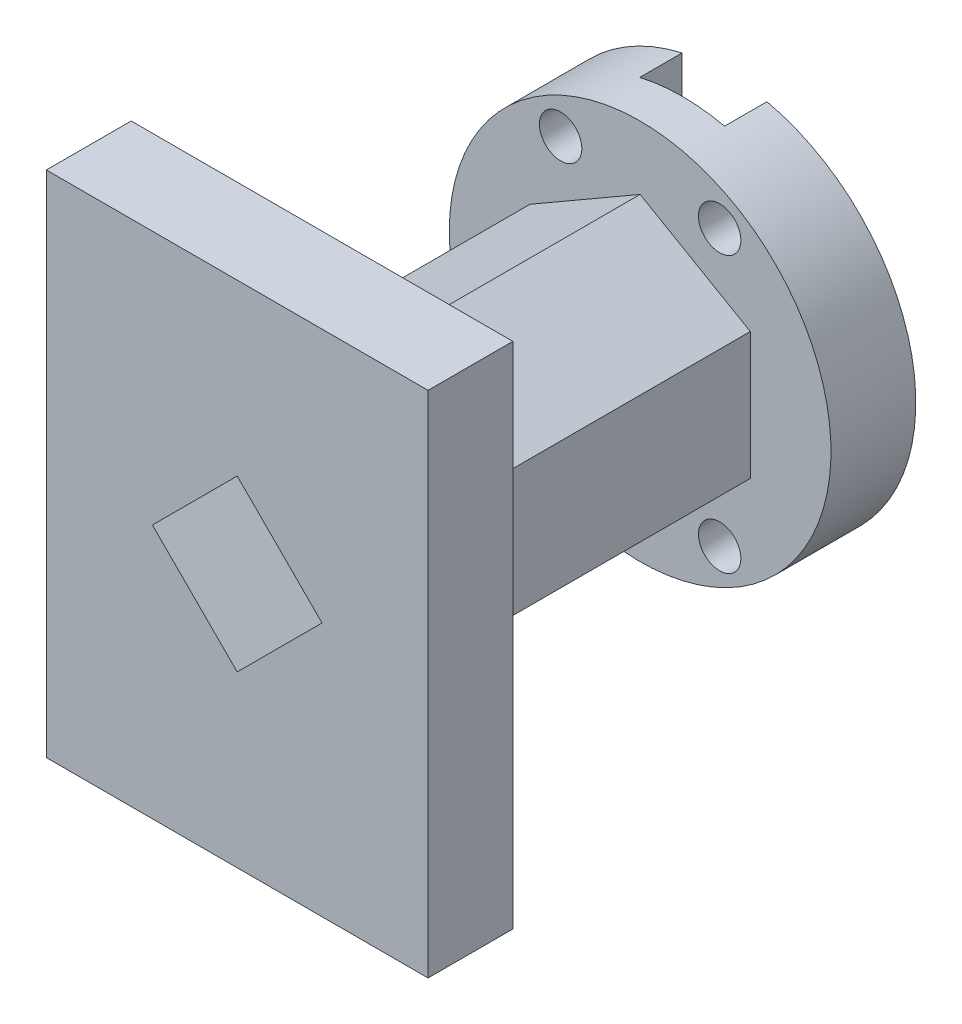
ISO-10303-21;
HEADER;
FILE_DESCRIPTION(('STEP AP214'),'2;1');
FILE_NAME('part.step','',(''),(''),'','','');
FILE_SCHEMA(('AUTOMOTIVE_DESIGN { 1 0 10303 214 1 1 1 1 }'));
ENDSEC;
DATA;
#1=APPLICATION_CONTEXT('core data for automotive mechanical design processes');
#2=APPLICATION_PROTOCOL_DEFINITION('international standard','automotive_design',2000,#1);
#3=PRODUCT_CONTEXT('',#1,'mechanical');
#4=PRODUCT('Part','Part','',(#3));
#5=PRODUCT_RELATED_PRODUCT_CATEGORY('part','',(#4));
#6=PRODUCT_DEFINITION_FORMATION('','',#4);
#7=PRODUCT_DEFINITION_CONTEXT('part definition',#1,'design');
#8=PRODUCT_DEFINITION('design','',#6,#7);
#9=PRODUCT_DEFINITION_SHAPE('','',#8);
#10=(LENGTH_UNIT() NAMED_UNIT(*) SI_UNIT(.MILLI.,.METRE.));
#11=(NAMED_UNIT(*) PLANE_ANGLE_UNIT() SI_UNIT($,.RADIAN.));
#12=(NAMED_UNIT(*) SI_UNIT($,.STERADIAN.) SOLID_ANGLE_UNIT());
#13=UNCERTAINTY_MEASURE_WITH_UNIT(LENGTH_MEASURE(1.E-05),#10,'distance_accuracy_value','');
#14=(GEOMETRIC_REPRESENTATION_CONTEXT(3) GLOBAL_UNCERTAINTY_ASSIGNED_CONTEXT((#13)) GLOBAL_UNIT_ASSIGNED_CONTEXT((#10,
#11,#12)) REPRESENTATION_CONTEXT('',''));
#15=CARTESIAN_POINT('',(0.,0.,0.));
#16=DIRECTION('',(0.,0.,1.));
#17=DIRECTION('',(1.,0.,0.));
#18=AXIS2_PLACEMENT_3D('',#15,#16,#17);
#19=CARTESIAN_POINT('',(0.,0.,-85.));
#20=DIRECTION('',(0.,0.,-1.));
#21=DIRECTION('',(-1.,0.,0.));
#22=AXIS2_PLACEMENT_3D('',#19,#20,#21);
#23=PLANE('',#22);
#24=DIRECTION('',(-0.707106781186547,0.707106781186548,0.));
#25=VECTOR('',#24,1.);
#26=CARTESIAN_POINT('',(-30.2974920931039,-30.2974920931039,-85.));
#27=LINE('',#26,#25);
#28=CARTESIAN_POINT('',(-78.0964504418021,17.5014662555944,-85.));
#29=VERTEX_POINT('',#28);
#30=CARTESIAN_POINT('',(-88.1832926056,27.5883084193922,-85.));
#31=VERTEX_POINT('',#30);
#32=EDGE_CURVE('E62',#29,#31,#27,.T.);
#33=ORIENTED_EDGE('',*,*,#32,.F.);
#34=DIRECTION('',(-0.707106781186547,-0.707106781186548,0.));
#35=VECTOR('',#34,1.);
#36=CARTESIAN_POINT('',(-47.7989583486983,47.7989583486982,-85.));
#37=LINE('',#36,#35);
#38=CARTESIAN_POINT('',(-68.1832926056,27.4146240917965,-85.));
#39=VERTEX_POINT('',#38);
#40=EDGE_CURVE('E236',#39,#29,#37,.T.);
#41=ORIENTED_EDGE('',*,*,#40,.F.);
#42=DIRECTION('',(0.,1.,0.));
#43=VECTOR('',#42,1.);
#44=CARTESIAN_POINT('',(-68.1832926056,-12.4286913438041,-85.));
#45=LINE('',#44,#43);
#46=CARTESIAN_POINT('',(-68.1832926056,-6.39305847944001,-85.));
#47=VERTEX_POINT('',#46);
#48=EDGE_CURVE('E267',#47,#39,#45,.T.);
#49=ORIENTED_EDGE('',*,*,#48,.F.);
#50=CARTESIAN_POINT('',(-78.0964504418022,37.5014662555944,-85.));
#51=DIRECTION('',(0.,0.,-1.));
#52=DIRECTION('',(-1.,0.,0.));
#53=AXIS2_PLACEMENT_3D('',#50,#51,#52);
#54=CIRCLE('',#53,45.);
#55=CARTESIAN_POINT('',(-88.1832926056,-6.35347206567834,-85.));
#56=VERTEX_POINT('',#55);
#57=EDGE_CURVE('E377',#47,#56,#54,.T.);
#58=ORIENTED_EDGE('',*,*,#57,.T.);
#59=DIRECTION('',(0.,1.,0.));
#60=VECTOR('',#59,1.);
#61=CARTESIAN_POINT('',(-88.1832926056,-12.4286913438041,-85.));
#62=LINE('',#61,#60);
#63=EDGE_CURVE('E263',#56,#31,#62,.T.);
#64=ORIENTED_EDGE('',*,*,#63,.T.);
#65=EDGE_LOOP('',(#33,#41,#49,#58,#64));
#66=FACE_BOUND('',#65,.T.);
#67=ADVANCED_FACE('F39',(#66),#23,.T.);
#68=CARTESIAN_POINT('',(-68.1832926056,-12.4286913438041,-85.));
#69=DIRECTION('',(-1.,0.,0.));
#70=DIRECTION('',(0.,0.,1.));
#71=AXIS2_PLACEMENT_3D('',#68,#69,#70);
#72=PLANE('',#71);
#73=DIRECTION('',(0.,0.,1.));
#74=VECTOR('',#73,1.);
#75=CARTESIAN_POINT('',(-68.1832926056,27.4146240917965,-85.));
#76=LINE('',#75,#74);
#77=CARTESIAN_POINT('',(-68.1832926056,27.4146240917965,-95.));
#78=VERTEX_POINT('',#77);
#79=EDGE_CURVE('E11',#78,#39,#76,.T.);
#80=ORIENTED_EDGE('',*,*,#79,.F.);
#81=DIRECTION('',(0.,1.,0.));
#82=VECTOR('',#81,1.);
#83=CARTESIAN_POINT('',(-68.1832926056,0.,-95.));
#84=LINE('',#83,#82);
#85=CARTESIAN_POINT('',(-68.1832926056,-6.39305847944001,-95.));
#86=VERTEX_POINT('',#85);
#87=EDGE_CURVE('E374',#86,#78,#84,.T.);
#88=ORIENTED_EDGE('',*,*,#87,.F.);
#89=DIRECTION('',(0.,0.,1.));
#90=VECTOR('',#89,1.);
#91=CARTESIAN_POINT('',(-68.1832926056,-6.39305847944001,-95.));
#92=LINE('',#91,#90);
#93=EDGE_CURVE('E279',#86,#47,#92,.T.);
#94=ORIENTED_EDGE('',*,*,#93,.T.);
#95=ORIENTED_EDGE('',*,*,#48,.T.);
#96=EDGE_LOOP('',(#80,#88,#94,#95));
#97=FACE_BOUND('',#96,.T.);
#98=ADVANCED_FACE('F405',(#97),#72,.T.);
#99=CARTESIAN_POINT('',(-88.1832926056,-12.4286913438041,-85.));
#100=DIRECTION('',(-1.,0.,0.));
#101=DIRECTION('',(0.,0.,1.));
#102=AXIS2_PLACEMENT_3D('',#99,#100,#101);
#103=PLANE('',#102);
#104=CARTESIAN_POINT('',(-88.1832926056,47.4146240917965,-85.));
#105=VERTEX_POINT('',#104);
#106=CARTESIAN_POINT('',(-88.1832926056,81.356404576867,-85.));
#107=VERTEX_POINT('',#106);
#108=EDGE_CURVE('E262',#105,#107,#62,.T.);
#109=ORIENTED_EDGE('',*,*,#108,.F.);
#110=DIRECTION('',(0.,0.,-1.));
#111=VECTOR('',#110,1.);
#112=CARTESIAN_POINT('',(-88.1832926056,47.4146240917965,-85.));
#113=LINE('',#112,#111);
#114=CARTESIAN_POINT('',(-88.1832926056,47.4146240917965,-95.));
#115=VERTEX_POINT('',#114);
#116=EDGE_CURVE('E381',#105,#115,#113,.T.);
#117=ORIENTED_EDGE('',*,*,#116,.T.);
#118=DIRECTION('',(0.,1.,0.));
#119=VECTOR('',#118,1.);
#120=CARTESIAN_POINT('',(-88.1832926056,0.,-95.));
#121=LINE('',#120,#119);
#122=CARTESIAN_POINT('',(-88.1832926056,81.356404576867,-95.));
#123=VERTEX_POINT('',#122);
#124=EDGE_CURVE('E212',#115,#123,#121,.T.);
#125=ORIENTED_EDGE('',*,*,#124,.T.);
#126=DIRECTION('',(0.,0.,1.));
#127=VECTOR('',#126,1.);
#128=CARTESIAN_POINT('',(-88.1832926056,81.356404576867,-95.));
#129=LINE('',#128,#127);
#130=EDGE_CURVE('E270',#107,#123,#129,.F.);
#131=ORIENTED_EDGE('',*,*,#130,.F.);
#132=EDGE_LOOP('',(#109,#117,#125,#131));
#133=FACE_BOUND('',#132,.T.);
#134=ADVANCED_FACE('F417',(#133),#103,.F.);
#135=CARTESIAN_POINT('',(0.,0.,-95.));
#136=DIRECTION('',(0.,0.,-1.));
#137=DIRECTION('',(-1.,0.,0.));
#138=AXIS2_PLACEMENT_3D('',#135,#136,#137);
#139=PLANE('',#138);
#140=DIRECTION('',(0.707106781186547,0.707106781186548,0.));
#141=VECTOR('',#140,1.);
#142=CARTESIAN_POINT('',(-78.0964504418021,17.5014662555944,-95.));
#143=LINE('',#142,#141);
#144=CARTESIAN_POINT('',(-58.0964504418021,37.5014662555944,-95.));
#145=VERTEX_POINT('',#144);
#146=EDGE_CURVE('E225',#78,#145,#143,.T.);
#147=ORIENTED_EDGE('',*,*,#146,.T.);
#148=DIRECTION('',(-0.707106781186547,0.707106781186548,0.));
#149=VECTOR('',#148,1.);
#150=CARTESIAN_POINT('',(-58.0964504418021,37.5014662555944,-95.));
#151=LINE('',#150,#149);
#152=CARTESIAN_POINT('',(-68.1832926056,47.5883084193923,-95.));
#153=VERTEX_POINT('',#152);
#154=EDGE_CURVE('E220',#145,#153,#151,.T.);
#155=ORIENTED_EDGE('',*,*,#154,.T.);
#156=CARTESIAN_POINT('',(-68.1832926056,81.3959909906287,-95.));
#157=VERTEX_POINT('',#156);
#158=EDGE_CURVE('E373',#153,#157,#84,.T.);
#159=ORIENTED_EDGE('',*,*,#158,.T.);
#160=CARTESIAN_POINT('',(-78.0964504418022,37.5014662555944,-95.));
#161=DIRECTION('',(0.,0.,-1.));
#162=DIRECTION('',(-1.,0.,0.));
#163=AXIS2_PLACEMENT_3D('',#160,#161,#162);
#164=CIRCLE('',#163,45.);
#165=EDGE_CURVE('E284',#157,#86,#164,.T.);
#166=ORIENTED_EDGE('',*,*,#165,.T.);
#167=ORIENTED_EDGE('',*,*,#87,.T.);
#168=EDGE_LOOP('',(#147,#155,#159,#166,#167));
#169=FACE_BOUND('',#168,.T.);
#170=CARTESIAN_POINT('',(-59.3464504418024,69.9774188975109,-95.));
#171=DIRECTION('',(0.,0.,-1.));
#172=DIRECTION('',(-1.,0.,0.));
#173=AXIS2_PLACEMENT_3D('',#170,#171,#172);
#174=CIRCLE('',#173,5.00000000000003);
#175=CARTESIAN_POINT('',(-64.3464504418024,69.9774188975109,-95.));
#176=VERTEX_POINT('',#175);
#177=EDGE_CURVE('E252',#176,#176,#174,.T.);
#178=ORIENTED_EDGE('',*,*,#177,.F.);
#179=EDGE_LOOP('',(#178));
#180=FACE_BOUND('',#179,.T.);
#181=CARTESIAN_POINT('',(-59.3464504418024,5.02551361367777,-95.));
#182=DIRECTION('',(0.,0.,-1.));
#183=DIRECTION('',(-1.,0.,0.));
#184=AXIS2_PLACEMENT_3D('',#181,#182,#183);
#185=CIRCLE('',#184,5.00000000000002);
#186=CARTESIAN_POINT('',(-64.3464504418024,5.02551361367777,-95.));
#187=VERTEX_POINT('',#186);
#188=EDGE_CURVE('E244',#187,#187,#185,.F.);
#189=ORIENTED_EDGE('',*,*,#188,.T.);
#190=EDGE_LOOP('',(#189));
#191=FACE_BOUND('',#190,.T.);
#192=ADVANCED_FACE('F391',(#169,#180,#191),#139,.T.);
#193=CARTESIAN_POINT('',(0.,0.,-75.));
#194=DIRECTION('',(0.,0.,-1.));
#195=DIRECTION('',(-1.,0.,0.));
#196=AXIS2_PLACEMENT_3D('',#193,#194,#195);
#197=PLANE('',#196);
#198=CARTESIAN_POINT('',(-96.846450441802,5.02551361367777,-75.));
#199=DIRECTION('',(0.,0.,-1.));
#200=DIRECTION('',(-1.,0.,0.));
#201=AXIS2_PLACEMENT_3D('',#198,#199,#200);
#202=CIRCLE('',#201,5.00000000000002);
#203=CARTESIAN_POINT('',(-101.846450441802,5.02551361367777,-75.));
#204=VERTEX_POINT('',#203);
#205=EDGE_CURVE('E241',#204,#204,#202,.F.);
#206=ORIENTED_EDGE('',*,*,#205,.F.);
#207=EDGE_LOOP('',(#206));
#208=FACE_BOUND('',#207,.T.);
#209=CARTESIAN_POINT('',(-59.3464504418024,69.9774188975109,-75.));
#210=DIRECTION('',(0.,0.,-1.));
#211=DIRECTION('',(-1.,0.,0.));
#212=AXIS2_PLACEMENT_3D('',#209,#210,#211);
#213=CIRCLE('',#212,5.00000000000003);
#214=CARTESIAN_POINT('',(-64.3464504418024,69.9774188975109,-75.));
#215=VERTEX_POINT('',#214);
#216=EDGE_CURVE('E259',#215,#215,#213,.F.);
#217=ORIENTED_EDGE('',*,*,#216,.F.);
#218=EDGE_LOOP('',(#217));
#219=FACE_BOUND('',#218,.T.);
#220=CARTESIAN_POINT('',(-78.0964504418022,37.5014662555944,-75.));
#221=DIRECTION('',(0.,0.,-1.));
#222=DIRECTION('',(-1.,0.,0.));
#223=AXIS2_PLACEMENT_3D('',#220,#221,#222);
#224=CIRCLE('',#223,45.);
#225=CARTESIAN_POINT('',(-123.096450441802,37.5014662555944,-75.));
#226=VERTEX_POINT('',#225);
#227=EDGE_CURVE('E281',#226,#226,#224,.T.);
#228=ORIENTED_EDGE('',*,*,#227,.F.);
#229=EDGE_LOOP('',(#228));
#230=FACE_BOUND('',#229,.T.);
#231=DIRECTION('',(0.866025403784442,0.499999999999995,0.));
#232=VECTOR('',#231,1.);
#233=CARTESIAN_POINT('',(-104.077212555335,52.5014662555946,-75.));
#234=LINE('',#233,#232);
#235=CARTESIAN_POINT('',(-104.077212555335,52.5014662555946,-75.));
#236=VERTEX_POINT('',#235);
#237=CARTESIAN_POINT('',(-78.0964504418021,67.5014662555944,-75.));
#238=VERTEX_POINT('',#237);
#239=EDGE_CURVE('E303',#236,#238,#234,.T.);
#240=ORIENTED_EDGE('',*,*,#239,.T.);
#241=DIRECTION('',(0.866025403784438,-0.500000000000001,0.));
#242=VECTOR('',#241,1.);
#243=CARTESIAN_POINT('',(-78.0964504418021,67.5014662555944,-75.));
#244=LINE('',#243,#242);
#245=CARTESIAN_POINT('',(-52.1156883282689,52.5014662555943,-75.));
#246=VERTEX_POINT('',#245);
#247=EDGE_CURVE('E287',#238,#246,#244,.T.);
#248=ORIENTED_EDGE('',*,*,#247,.T.);
#249=DIRECTION('',(0.,-1.,0.));
#250=VECTOR('',#249,1.);
#251=CARTESIAN_POINT('',(-52.1156883282689,52.5014662555943,-75.));
#252=LINE('',#251,#250);
#253=CARTESIAN_POINT('',(-52.115688328269,22.5014662555942,-75.));
#254=VERTEX_POINT('',#253);
#255=EDGE_CURVE('E290',#246,#254,#252,.T.);
#256=ORIENTED_EDGE('',*,*,#255,.T.);
#257=DIRECTION('',(-0.866025403784442,-0.499999999999995,0.));
#258=VECTOR('',#257,1.);
#259=CARTESIAN_POINT('',(-52.115688328269,22.5014662555942,-75.));
#260=LINE('',#259,#258);
#261=CARTESIAN_POINT('',(-78.0964504418023,7.50146625559435,-75.));
#262=VERTEX_POINT('',#261);
#263=EDGE_CURVE('E294',#254,#262,#260,.T.);
#264=ORIENTED_EDGE('',*,*,#263,.T.);
#265=DIRECTION('',(-0.866025403784435,0.500000000000007,0.));
#266=VECTOR('',#265,1.);
#267=CARTESIAN_POINT('',(-78.0964504418023,7.50146625559435,-75.));
#268=LINE('',#267,#266);
#269=CARTESIAN_POINT('',(-104.077212555335,22.5014662555946,-75.));
#270=VERTEX_POINT('',#269);
#271=EDGE_CURVE('E297',#262,#270,#268,.T.);
#272=ORIENTED_EDGE('',*,*,#271,.T.);
#273=DIRECTION('',(0.,1.,0.));
#274=VECTOR('',#273,1.);
#275=CARTESIAN_POINT('',(-104.077212555335,22.5014662555946,-75.));
#276=LINE('',#275,#274);
#277=EDGE_CURVE('E300',#270,#236,#276,.T.);
#278=ORIENTED_EDGE('',*,*,#277,.T.);
#279=EDGE_LOOP('',(#240,#248,#256,#264,#272,#278));
#280=FACE_BOUND('',#279,.T.);
#281=CARTESIAN_POINT('',(-59.3464504418024,5.02551361367777,-75.));
#282=DIRECTION('',(0.,0.,-1.));
#283=DIRECTION('',(-1.,0.,0.));
#284=AXIS2_PLACEMENT_3D('',#281,#282,#283);
#285=CIRCLE('',#284,5.00000000000002);
#286=CARTESIAN_POINT('',(-64.3464504418024,5.02551361367777,-75.));
#287=VERTEX_POINT('',#286);
#288=EDGE_CURVE('E249',#287,#287,#285,.T.);
#289=ORIENTED_EDGE('',*,*,#288,.T.);
#290=EDGE_LOOP('',(#289));
#291=FACE_BOUND('',#290,.T.);
#292=CARTESIAN_POINT('',(-96.846450441802,69.9774188975109,-75.));
#293=DIRECTION('',(0.,0.,-1.));
#294=DIRECTION('',(-1.,0.,0.));
#295=AXIS2_PLACEMENT_3D('',#292,#293,#294);
#296=CIRCLE('',#295,5.00000000000002);
#297=CARTESIAN_POINT('',(-101.846450441802,69.9774188975109,-75.));
#298=VERTEX_POINT('',#297);
#299=EDGE_CURVE('E248',#298,#298,#296,.T.);
#300=ORIENTED_EDGE('',*,*,#299,.T.);
#301=EDGE_LOOP('',(#300));
#302=FACE_BOUND('',#301,.T.);
#303=ADVANCED_FACE('F446',(#208,#219,#230,#280,#291,#302),#197,.F.);
#304=DIRECTION('',(-0.707106781186548,-0.707106781186548,0.));
#305=VECTOR('',#304,1.);
#306=CARTESIAN_POINT('',(-78.0964504418021,57.5014662555944,-95.));
#307=LINE('',#306,#305);
#308=CARTESIAN_POINT('',(-98.0964504418021,37.5014662555944,-95.));
#309=VERTEX_POINT('',#308);
#310=EDGE_CURVE('E202',#115,#309,#307,.T.);
#311=ORIENTED_EDGE('',*,*,#310,.T.);
#312=DIRECTION('',(0.707106781186547,-0.707106781186548,0.));
#313=VECTOR('',#312,1.);
#314=CARTESIAN_POINT('',(-98.0964504418021,37.5014662555944,-95.));
#315=LINE('',#314,#313);
#316=CARTESIAN_POINT('',(-88.1832926056,27.5883084193922,-95.));
#317=VERTEX_POINT('',#316);
#318=EDGE_CURVE('E187',#309,#317,#315,.T.);
#319=ORIENTED_EDGE('',*,*,#318,.T.);
#320=CARTESIAN_POINT('',(-88.1832926056,-6.35347206567834,-95.));
#321=VERTEX_POINT('',#320);
#322=EDGE_CURVE('E371',#321,#317,#121,.T.);
#323=ORIENTED_EDGE('',*,*,#322,.F.);
#324=EDGE_CURVE('E282',#321,#123,#164,.T.);
#325=ORIENTED_EDGE('',*,*,#324,.T.);
#326=ORIENTED_EDGE('',*,*,#124,.F.);
#327=EDGE_LOOP('',(#311,#319,#323,#325,#326));
#328=FACE_BOUND('',#327,.T.);
#329=CARTESIAN_POINT('',(-96.846450441802,5.02551361367777,-95.));
#330=DIRECTION('',(0.,0.,-1.));
#331=DIRECTION('',(-1.,0.,0.));
#332=AXIS2_PLACEMENT_3D('',#329,#330,#331);
#333=CIRCLE('',#332,5.00000000000002);
#334=CARTESIAN_POINT('',(-101.846450441802,5.02551361367777,-95.));
#335=VERTEX_POINT('',#334);
#336=EDGE_CURVE('E238',#335,#335,#333,.T.);
#337=ORIENTED_EDGE('',*,*,#336,.F.);
#338=EDGE_LOOP('',(#337));
#339=FACE_BOUND('',#338,.T.);
#340=CARTESIAN_POINT('',(-96.846450441802,69.9774188975109,-95.));
#341=DIRECTION('',(0.,0.,-1.));
#342=DIRECTION('',(-1.,0.,0.));
#343=AXIS2_PLACEMENT_3D('',#340,#341,#342);
#344=CIRCLE('',#343,5.00000000000002);
#345=CARTESIAN_POINT('',(-101.846450441802,69.9774188975109,-95.));
#346=VERTEX_POINT('',#345);
#347=EDGE_CURVE('E245',#346,#346,#344,.F.);
#348=ORIENTED_EDGE('',*,*,#347,.T.);
#349=EDGE_LOOP('',(#348));
#350=FACE_BOUND('',#349,.T.);
#351=ADVANCED_FACE('F209',(#328,#339,#350),#139,.T.);
#352=CARTESIAN_POINT('',(-78.0964504418022,37.5014662555944,-95.));
#353=DIRECTION('',(0.,0.,1.));
#354=DIRECTION('',(1.,0.,0.));
#355=AXIS2_PLACEMENT_3D('',#352,#353,#354);
#356=CYLINDRICAL_SURFACE('',#355,45.);
#357=ORIENTED_EDGE('',*,*,#227,.T.);
#358=EDGE_LOOP('',(#357));
#359=FACE_BOUND('',#358,.T.);
#360=DIRECTION('',(0.,0.,1.));
#361=VECTOR('',#360,1.);
#362=CARTESIAN_POINT('',(-68.1832926056,81.3959909906287,-95.));
#363=LINE('',#362,#361);
#364=CARTESIAN_POINT('',(-68.1832926056,81.3959909906287,-85.));
#365=VERTEX_POINT('',#364);
#366=EDGE_CURVE('E276',#365,#157,#363,.F.);
#367=ORIENTED_EDGE('',*,*,#366,.F.);
#368=EDGE_CURVE('E379',#107,#365,#54,.T.);
#369=ORIENTED_EDGE('',*,*,#368,.F.);
#370=ORIENTED_EDGE('',*,*,#130,.T.);
#371=ORIENTED_EDGE('',*,*,#324,.F.);
#372=DIRECTION('',(0.,0.,1.));
#373=VECTOR('',#372,1.);
#374=CARTESIAN_POINT('',(-88.1832926056,-6.35347206567834,-95.));
#375=LINE('',#374,#373);
#376=EDGE_CURVE('E273',#321,#56,#375,.T.);
#377=ORIENTED_EDGE('',*,*,#376,.T.);
#378=ORIENTED_EDGE('',*,*,#57,.F.);
#379=ORIENTED_EDGE('',*,*,#93,.F.);
#380=ORIENTED_EDGE('',*,*,#165,.F.);
#381=EDGE_LOOP('',(#367,#369,#370,#371,#377,#378,#379,#380));
#382=FACE_BOUND('',#381,.T.);
#383=ADVANCED_FACE('F401',(#359,#382),#356,.T.);
#384=CARTESIAN_POINT('',(-123.096450441802,-22.4985337444056,20.));
#385=DIRECTION('',(0.,1.,0.));
#386=DIRECTION('',(0.,0.,1.));
#387=AXIS2_PLACEMENT_3D('',#384,#385,#386);
#388=PLANE('',#387);
#389=DIRECTION('',(1.,0.,0.));
#390=VECTOR('',#389,1.);
#391=CARTESIAN_POINT('',(-123.096450441802,-22.4985337444056,0.));
#392=LINE('',#391,#390);
#393=CARTESIAN_POINT('',(-123.096450441802,-22.4985337444056,0.));
#394=VERTEX_POINT('',#393);
#395=CARTESIAN_POINT('',(-33.0964504418021,-22.4985337444056,0.));
#396=VERTEX_POINT('',#395);
#397=EDGE_CURVE('E341',#394,#396,#392,.T.);
#398=ORIENTED_EDGE('',*,*,#397,.T.);
#399=DIRECTION('',(0.,0.,-1.));
#400=VECTOR('',#399,1.);
#401=CARTESIAN_POINT('',(-33.0964504418021,-22.4985337444056,20.));
#402=LINE('',#401,#400);
#403=CARTESIAN_POINT('',(-33.0964504418021,-22.4985337444056,20.));
#404=VERTEX_POINT('',#403);
#405=EDGE_CURVE('E369',#404,#396,#402,.T.);
#406=ORIENTED_EDGE('',*,*,#405,.F.);
#407=DIRECTION('',(1.,0.,0.));
#408=VECTOR('',#407,1.);
#409=CARTESIAN_POINT('',(-123.096450441802,-22.4985337444056,20.));
#410=LINE('',#409,#408);
#411=CARTESIAN_POINT('',(-123.096450441802,-22.4985337444056,20.));
#412=VERTEX_POINT('',#411);
#413=EDGE_CURVE('E342',#412,#404,#410,.T.);
#414=ORIENTED_EDGE('',*,*,#413,.F.);
#415=DIRECTION('',(0.,0.,-1.));
#416=VECTOR('',#415,1.);
#417=CARTESIAN_POINT('',(-123.096450441802,-22.4985337444056,20.));
#418=LINE('',#417,#416);
#419=EDGE_CURVE('E353',#412,#394,#418,.T.);
#420=ORIENTED_EDGE('',*,*,#419,.T.);
#421=EDGE_LOOP('',(#398,#406,#414,#420));
#422=FACE_BOUND('',#421,.T.);
#423=ADVANCED_FACE('F41',(#422),#388,.F.);
#424=CARTESIAN_POINT('',(-33.0964504418021,97.5014662555944,20.));
#425=DIRECTION('',(1.,0.,0.));
#426=DIRECTION('',(0.,1.,0.));
#427=AXIS2_PLACEMENT_3D('',#424,#425,#426);
#428=PLANE('',#427);
#429=DIRECTION('',(0.,-1.,0.));
#430=VECTOR('',#429,1.);
#431=CARTESIAN_POINT('',(-33.0964504418021,97.5014662555944,0.));
#432=LINE('',#431,#430);
#433=CARTESIAN_POINT('',(-33.0964504418021,97.5014662555944,0.));
#434=VERTEX_POINT('',#433);
#435=EDGE_CURVE('E356',#434,#396,#432,.T.);
#436=ORIENTED_EDGE('',*,*,#435,.F.);
#437=DIRECTION('',(0.,0.,-1.));
#438=VECTOR('',#437,1.);
#439=CARTESIAN_POINT('',(-33.0964504418021,97.5014662555944,20.));
#440=LINE('',#439,#438);
#441=CARTESIAN_POINT('',(-33.0964504418021,97.5014662555944,20.));
#442=VERTEX_POINT('',#441);
#443=EDGE_CURVE('E367',#442,#434,#440,.T.);
#444=ORIENTED_EDGE('',*,*,#443,.F.);
#445=DIRECTION('',(0.,-1.,0.));
#446=VECTOR('',#445,1.);
#447=CARTESIAN_POINT('',(-33.0964504418021,97.5014662555944,20.));
#448=LINE('',#447,#446);
#449=EDGE_CURVE('E344',#442,#404,#448,.T.);
#450=ORIENTED_EDGE('',*,*,#449,.T.);
#451=ORIENTED_EDGE('',*,*,#405,.T.);
#452=EDGE_LOOP('',(#436,#444,#450,#451));
#453=FACE_BOUND('',#452,.T.);
#454=ADVANCED_FACE('F486',(#453),#428,.T.);
#455=CARTESIAN_POINT('',(-123.096450441802,97.5014662555944,20.));
#456=DIRECTION('',(0.,1.,0.));
#457=DIRECTION('',(0.,0.,1.));
#458=AXIS2_PLACEMENT_3D('',#455,#456,#457);
#459=PLANE('',#458);
#460=DIRECTION('',(1.,0.,0.));
#461=VECTOR('',#460,1.);
#462=CARTESIAN_POINT('',(-123.096450441802,97.5014662555944,0.));
#463=LINE('',#462,#461);
#464=CARTESIAN_POINT('',(-123.096450441802,97.5014662555944,0.));
#465=VERTEX_POINT('',#464);
#466=EDGE_CURVE('E359',#465,#434,#463,.T.);
#467=ORIENTED_EDGE('',*,*,#466,.F.);
#468=DIRECTION('',(0.,0.,-1.));
#469=VECTOR('',#468,1.);
#470=CARTESIAN_POINT('',(-123.096450441802,97.5014662555944,20.));
#471=LINE('',#470,#469);
#472=CARTESIAN_POINT('',(-123.096450441802,97.5014662555944,20.));
#473=VERTEX_POINT('',#472);
#474=EDGE_CURVE('E365',#473,#465,#471,.T.);
#475=ORIENTED_EDGE('',*,*,#474,.F.);
#476=DIRECTION('',(1.,0.,0.));
#477=VECTOR('',#476,1.);
#478=CARTESIAN_POINT('',(-123.096450441802,97.5014662555944,20.));
#479=LINE('',#478,#477);
#480=EDGE_CURVE('E348',#473,#442,#479,.T.);
#481=ORIENTED_EDGE('',*,*,#480,.T.);
#482=ORIENTED_EDGE('',*,*,#443,.T.);
#483=EDGE_LOOP('',(#467,#475,#481,#482));
#484=FACE_BOUND('',#483,.T.);
#485=ADVANCED_FACE('F483',(#484),#459,.T.);
#486=CARTESIAN_POINT('',(-123.096450441802,97.5014662555944,20.));
#487=DIRECTION('',(1.,0.,0.));
#488=DIRECTION('',(0.,1.,0.));
#489=AXIS2_PLACEMENT_3D('',#486,#487,#488);
#490=PLANE('',#489);
#491=DIRECTION('',(0.,-1.,0.));
#492=VECTOR('',#491,1.);
#493=CARTESIAN_POINT('',(-123.096450441802,97.5014662555944,0.));
#494=LINE('',#493,#492);
#495=EDGE_CURVE('E345',#465,#394,#494,.T.);
#496=ORIENTED_EDGE('',*,*,#495,.T.);
#497=ORIENTED_EDGE('',*,*,#419,.F.);
#498=DIRECTION('',(0.,-1.,0.));
#499=VECTOR('',#498,1.);
#500=CARTESIAN_POINT('',(-123.096450441802,97.5014662555944,20.));
#501=LINE('',#500,#499);
#502=EDGE_CURVE('E351',#473,#412,#501,.T.);
#503=ORIENTED_EDGE('',*,*,#502,.F.);
#504=ORIENTED_EDGE('',*,*,#474,.T.);
#505=EDGE_LOOP('',(#496,#497,#503,#504));
#506=FACE_BOUND('',#505,.T.);
#507=ADVANCED_FACE('F476',(#506),#490,.F.);
#508=CARTESIAN_POINT('',(0.,0.,20.));
#509=DIRECTION('',(0.,0.,-1.));
#510=DIRECTION('',(-1.,0.,0.));
#511=AXIS2_PLACEMENT_3D('',#508,#509,#510);
#512=PLANE('',#511);
#513=DIRECTION('',(0.707106781186547,-0.707106781186548,0.));
#514=VECTOR('',#513,1.);
#515=CARTESIAN_POINT('',(-98.0964504418021,37.5014662555944,20.));
#516=LINE('',#515,#514);
#517=CARTESIAN_POINT('',(-98.0964504418021,37.5014662555944,20.));
#518=VERTEX_POINT('',#517);
#519=CARTESIAN_POINT('',(-78.0964504418021,17.5014662555944,20.));
#520=VERTEX_POINT('',#519);
#521=EDGE_CURVE('E214',#518,#520,#516,.T.);
#522=ORIENTED_EDGE('',*,*,#521,.F.);
#523=DIRECTION('',(-0.707106781186547,-0.707106781186547,0.));
#524=VECTOR('',#523,1.);
#525=CARTESIAN_POINT('',(-78.0964504418021,57.5014662555944,20.));
#526=LINE('',#525,#524);
#527=CARTESIAN_POINT('',(-78.0964504418021,57.5014662555944,20.));
#528=VERTEX_POINT('',#527);
#529=EDGE_CURVE('E205',#528,#518,#526,.T.);
#530=ORIENTED_EDGE('',*,*,#529,.F.);
#531=DIRECTION('',(-0.707106781186547,0.707106781186548,0.));
#532=VECTOR('',#531,1.);
#533=CARTESIAN_POINT('',(-58.0964504418021,37.5014662555944,20.));
#534=LINE('',#533,#532);
#535=CARTESIAN_POINT('',(-58.0964504418021,37.5014662555944,20.));
#536=VERTEX_POINT('',#535);
#537=EDGE_CURVE('E218',#536,#528,#534,.T.);
#538=ORIENTED_EDGE('',*,*,#537,.F.);
#539=DIRECTION('',(0.707106781186547,0.707106781186548,0.));
#540=VECTOR('',#539,1.);
#541=CARTESIAN_POINT('',(-78.0964504418021,17.5014662555944,20.));
#542=LINE('',#541,#540);
#543=EDGE_CURVE('E54',#520,#536,#542,.T.);
#544=ORIENTED_EDGE('',*,*,#543,.F.);
#545=EDGE_LOOP('',(#522,#530,#538,#544));
#546=FACE_BOUND('',#545,.T.);
#547=ORIENTED_EDGE('',*,*,#413,.T.);
#548=ORIENTED_EDGE('',*,*,#449,.F.);
#549=ORIENTED_EDGE('',*,*,#480,.F.);
#550=ORIENTED_EDGE('',*,*,#502,.T.);
#551=EDGE_LOOP('',(#547,#548,#549,#550));
#552=FACE_BOUND('',#551,.T.);
#553=ADVANCED_FACE('F473',(#546,#552),#512,.F.);
#554=CARTESIAN_POINT('',(0.,0.,0.));
#555=DIRECTION('',(0.,0.,-1.));
#556=DIRECTION('',(-1.,0.,0.));
#557=AXIS2_PLACEMENT_3D('',#554,#555,#556);
#558=PLANE('',#557);
#559=DIRECTION('',(0.866025403784438,-0.500000000000001,0.));
#560=VECTOR('',#559,1.);
#561=CARTESIAN_POINT('',(-78.0964504418021,67.5014662555944,0.));
#562=LINE('',#561,#560);
#563=CARTESIAN_POINT('',(-78.0964504418021,67.5014662555944,0.));
#564=VERTEX_POINT('',#563);
#565=CARTESIAN_POINT('',(-52.1156883282689,52.5014662555943,0.));
#566=VERTEX_POINT('',#565);
#567=EDGE_CURVE('E307',#564,#566,#562,.T.);
#568=ORIENTED_EDGE('',*,*,#567,.F.);
#569=DIRECTION('',(0.866025403784442,0.499999999999995,0.));
#570=VECTOR('',#569,1.);
#571=CARTESIAN_POINT('',(-104.077212555335,52.5014662555946,0.));
#572=LINE('',#571,#570);
#573=CARTESIAN_POINT('',(-104.077212555335,52.5014662555946,0.));
#574=VERTEX_POINT('',#573);
#575=EDGE_CURVE('E291',#574,#564,#572,.T.);
#576=ORIENTED_EDGE('',*,*,#575,.F.);
#577=DIRECTION('',(0.,1.,0.));
#578=VECTOR('',#577,1.);
#579=CARTESIAN_POINT('',(-104.077212555335,22.5014662555946,0.));
#580=LINE('',#579,#578);
#581=CARTESIAN_POINT('',(-104.077212555335,22.5014662555946,0.));
#582=VERTEX_POINT('',#581);
#583=EDGE_CURVE('E319',#582,#574,#580,.T.);
#584=ORIENTED_EDGE('',*,*,#583,.F.);
#585=DIRECTION('',(-0.866025403784435,0.500000000000007,0.));
#586=VECTOR('',#585,1.);
#587=CARTESIAN_POINT('',(-78.0964504418023,7.50146625559435,0.));
#588=LINE('',#587,#586);
#589=CARTESIAN_POINT('',(-78.0964504418023,7.50146625559435,0.));
#590=VERTEX_POINT('',#589);
#591=EDGE_CURVE('E316',#590,#582,#588,.T.);
#592=ORIENTED_EDGE('',*,*,#591,.F.);
#593=DIRECTION('',(-0.866025403784442,-0.499999999999995,0.));
#594=VECTOR('',#593,1.);
#595=CARTESIAN_POINT('',(-52.115688328269,22.5014662555942,0.));
#596=LINE('',#595,#594);
#597=CARTESIAN_POINT('',(-52.115688328269,22.5014662555942,0.));
#598=VERTEX_POINT('',#597);
#599=EDGE_CURVE('E313',#598,#590,#596,.T.);
#600=ORIENTED_EDGE('',*,*,#599,.F.);
#601=DIRECTION('',(0.,-1.,0.));
#602=VECTOR('',#601,1.);
#603=CARTESIAN_POINT('',(-52.1156883282689,52.5014662555943,0.));
#604=LINE('',#603,#602);
#605=EDGE_CURVE('E310',#566,#598,#604,.T.);
#606=ORIENTED_EDGE('',*,*,#605,.F.);
#607=EDGE_LOOP('',(#568,#576,#584,#592,#600,#606));
#608=FACE_BOUND('',#607,.T.);
#609=ORIENTED_EDGE('',*,*,#397,.F.);
#610=ORIENTED_EDGE('',*,*,#495,.F.);
#611=ORIENTED_EDGE('',*,*,#466,.T.);
#612=ORIENTED_EDGE('',*,*,#435,.T.);
#613=EDGE_LOOP('',(#609,#610,#611,#612));
#614=FACE_BOUND('',#613,.T.);
#615=ADVANCED_FACE('F471',(#608,#614),#558,.T.);
#616=CARTESIAN_POINT('',(-78.0964504418021,67.5014662555944,-75.));
#617=DIRECTION('',(-0.500000000000001,-0.866025403784438,0.));
#618=DIRECTION('',(0.866025403784438,-0.500000000000001,0.));
#619=AXIS2_PLACEMENT_3D('',#616,#617,#618);
#620=PLANE('',#619);
#621=ORIENTED_EDGE('',*,*,#567,.T.);
#622=DIRECTION('',(0.,0.,1.));
#623=VECTOR('',#622,1.);
#624=CARTESIAN_POINT('',(-52.1156883282689,52.5014662555943,-75.));
#625=LINE('',#624,#623);
#626=EDGE_CURVE('E338',#246,#566,#625,.T.);
#627=ORIENTED_EDGE('',*,*,#626,.F.);
#628=ORIENTED_EDGE('',*,*,#247,.F.);
#629=DIRECTION('',(0.,0.,1.));
#630=VECTOR('',#629,1.);
#631=CARTESIAN_POINT('',(-78.0964504418021,67.5014662555944,-75.));
#632=LINE('',#631,#630);
#633=EDGE_CURVE('E306',#238,#564,#632,.T.);
#634=ORIENTED_EDGE('',*,*,#633,.T.);
#635=EDGE_LOOP('',(#621,#627,#628,#634));
#636=FACE_BOUND('',#635,.T.);
#637=ADVANCED_FACE('F467',(#636),#620,.F.);
#638=CARTESIAN_POINT('',(-52.1156883282689,52.5014662555943,-75.));
#639=DIRECTION('',(-1.,0.,0.));
#640=DIRECTION('',(0.,-1.,0.));
#641=AXIS2_PLACEMENT_3D('',#638,#639,#640);
#642=PLANE('',#641);
#643=ORIENTED_EDGE('',*,*,#605,.T.);
#644=DIRECTION('',(0.,0.,1.));
#645=VECTOR('',#644,1.);
#646=CARTESIAN_POINT('',(-52.115688328269,22.5014662555942,-75.));
#647=LINE('',#646,#645);
#648=EDGE_CURVE('E335',#254,#598,#647,.T.);
#649=ORIENTED_EDGE('',*,*,#648,.F.);
#650=ORIENTED_EDGE('',*,*,#255,.F.);
#651=ORIENTED_EDGE('',*,*,#626,.T.);
#652=EDGE_LOOP('',(#643,#649,#650,#651));
#653=FACE_BOUND('',#652,.T.);
#654=ADVANCED_FACE('F463',(#653),#642,.F.);
#655=CARTESIAN_POINT('',(-52.115688328269,22.5014662555942,-75.));
#656=DIRECTION('',(-0.499999999999995,0.866025403784442,0.));
#657=DIRECTION('',(-0.866025403784442,-0.499999999999995,0.));
#658=AXIS2_PLACEMENT_3D('',#655,#656,#657);
#659=PLANE('',#658);
#660=ORIENTED_EDGE('',*,*,#599,.T.);
#661=DIRECTION('',(0.,0.,1.));
#662=VECTOR('',#661,1.);
#663=CARTESIAN_POINT('',(-78.0964504418023,7.50146625559435,-75.));
#664=LINE('',#663,#662);
#665=EDGE_CURVE('E332',#262,#590,#664,.T.);
#666=ORIENTED_EDGE('',*,*,#665,.F.);
#667=ORIENTED_EDGE('',*,*,#263,.F.);
#668=ORIENTED_EDGE('',*,*,#648,.T.);
#669=EDGE_LOOP('',(#660,#666,#667,#668));
#670=FACE_BOUND('',#669,.T.);
#671=ADVANCED_FACE('F459',(#670),#659,.F.);
#672=CARTESIAN_POINT('',(-78.0964504418023,7.50146625559435,-75.));
#673=DIRECTION('',(0.500000000000007,0.866025403784435,0.));
#674=DIRECTION('',(-0.866025403784435,0.500000000000007,0.));
#675=AXIS2_PLACEMENT_3D('',#672,#673,#674);
#676=PLANE('',#675);
#677=ORIENTED_EDGE('',*,*,#591,.T.);
#678=DIRECTION('',(0.,0.,1.));
#679=VECTOR('',#678,1.);
#680=CARTESIAN_POINT('',(-104.077212555335,22.5014662555946,-75.));
#681=LINE('',#680,#679);
#682=EDGE_CURVE('E329',#270,#582,#681,.T.);
#683=ORIENTED_EDGE('',*,*,#682,.F.);
#684=ORIENTED_EDGE('',*,*,#271,.F.);
#685=ORIENTED_EDGE('',*,*,#665,.T.);
#686=EDGE_LOOP('',(#677,#683,#684,#685));
#687=FACE_BOUND('',#686,.T.);
#688=ADVANCED_FACE('F455',(#687),#676,.F.);
#689=CARTESIAN_POINT('',(-104.077212555335,22.5014662555946,-75.));
#690=DIRECTION('',(1.,0.,0.));
#691=DIRECTION('',(0.,1.,0.));
#692=AXIS2_PLACEMENT_3D('',#689,#690,#691);
#693=PLANE('',#692);
#694=ORIENTED_EDGE('',*,*,#583,.T.);
#695=DIRECTION('',(0.,0.,1.));
#696=VECTOR('',#695,1.);
#697=CARTESIAN_POINT('',(-104.077212555335,52.5014662555946,-75.));
#698=LINE('',#697,#696);
#699=EDGE_CURVE('E326',#236,#574,#698,.T.);
#700=ORIENTED_EDGE('',*,*,#699,.F.);
#701=ORIENTED_EDGE('',*,*,#277,.F.);
#702=ORIENTED_EDGE('',*,*,#682,.T.);
#703=EDGE_LOOP('',(#694,#700,#701,#702));
#704=FACE_BOUND('',#703,.T.);
#705=ADVANCED_FACE('F429',(#704),#693,.F.);
#706=CARTESIAN_POINT('',(-104.077212555335,52.5014662555946,-75.));
#707=DIRECTION('',(0.499999999999995,-0.866025403784441,0.));
#708=DIRECTION('',(0.866025403784441,0.499999999999995,0.));
#709=AXIS2_PLACEMENT_3D('',#706,#707,#708);
#710=PLANE('',#709);
#711=ORIENTED_EDGE('',*,*,#575,.T.);
#712=ORIENTED_EDGE('',*,*,#633,.F.);
#713=ORIENTED_EDGE('',*,*,#239,.F.);
#714=ORIENTED_EDGE('',*,*,#699,.T.);
#715=EDGE_LOOP('',(#711,#712,#713,#714));
#716=FACE_BOUND('',#715,.T.);
#717=ADVANCED_FACE('F422',(#716),#710,.F.);
#718=DIRECTION('',(0.707106781186548,0.707106781186548,0.));
#719=VECTOR('',#718,1.);
#720=CARTESIAN_POINT('',(-67.7989583486982,67.7989583486982,-85.));
#721=LINE('',#720,#719);
#722=CARTESIAN_POINT('',(-78.0964504418021,57.5014662555944,-85.));
#723=VERTEX_POINT('',#722);
#724=EDGE_CURVE('E232',#105,#723,#721,.T.);
#725=ORIENTED_EDGE('',*,*,#724,.F.);
#726=ORIENTED_EDGE('',*,*,#108,.T.);
#727=ORIENTED_EDGE('',*,*,#368,.T.);
#728=CARTESIAN_POINT('',(-68.1832926056,47.5883084193923,-85.));
#729=VERTEX_POINT('',#728);
#730=EDGE_CURVE('E266',#729,#365,#45,.T.);
#731=ORIENTED_EDGE('',*,*,#730,.F.);
#732=DIRECTION('',(0.707106781186547,-0.707106781186548,0.));
#733=VECTOR('',#732,1.);
#734=CARTESIAN_POINT('',(-10.2974920931039,-10.2974920931039,-85.));
#735=LINE('',#734,#733);
#736=EDGE_CURVE('E234',#723,#729,#735,.T.);
#737=ORIENTED_EDGE('',*,*,#736,.F.);
#738=EDGE_LOOP('',(#725,#726,#727,#731,#737));
#739=FACE_BOUND('',#738,.T.);
#740=ADVANCED_FACE('F420',(#739),#23,.T.);
#741=DIRECTION('',(0.,0.,-1.));
#742=VECTOR('',#741,1.);
#743=CARTESIAN_POINT('',(-68.1832926056,47.5883084193923,-85.));
#744=LINE('',#743,#742);
#745=EDGE_CURVE('E47',#729,#153,#744,.T.);
#746=ORIENTED_EDGE('',*,*,#745,.F.);
#747=ORIENTED_EDGE('',*,*,#730,.T.);
#748=ORIENTED_EDGE('',*,*,#366,.T.);
#749=ORIENTED_EDGE('',*,*,#158,.F.);
#750=EDGE_LOOP('',(#746,#747,#748,#749));
#751=FACE_BOUND('',#750,.T.);
#752=ADVANCED_FACE('F394',(#751),#72,.T.);
#753=ORIENTED_EDGE('',*,*,#322,.T.);
#754=DIRECTION('',(0.,0.,1.));
#755=VECTOR('',#754,1.);
#756=CARTESIAN_POINT('',(-88.1832926056,27.5883084193922,-85.));
#757=LINE('',#756,#755);
#758=EDGE_CURVE('E193',#317,#31,#757,.T.);
#759=ORIENTED_EDGE('',*,*,#758,.T.);
#760=ORIENTED_EDGE('',*,*,#63,.F.);
#761=ORIENTED_EDGE('',*,*,#376,.F.);
#762=EDGE_LOOP('',(#753,#759,#760,#761));
#763=FACE_BOUND('',#762,.T.);
#764=ADVANCED_FACE('F412',(#763),#103,.F.);
#765=CARTESIAN_POINT('',(-96.846450441802,5.02551361367777,-60.857864376269));
#766=DIRECTION('',(0.,0.,-1.));
#767=DIRECTION('',(-1.,0.,0.));
#768=AXIS2_PLACEMENT_3D('',#765,#766,#767);
#769=CYLINDRICAL_SURFACE('',#768,5.00000000000002);
#770=ORIENTED_EDGE('',*,*,#205,.T.);
#771=EDGE_LOOP('',(#770));
#772=FACE_BOUND('',#771,.T.);
#773=ORIENTED_EDGE('',*,*,#336,.T.);
#774=EDGE_LOOP('',(#773));
#775=FACE_BOUND('',#774,.T.);
#776=ADVANCED_FACE('F443',(#772,#775),#769,.F.);
#777=CARTESIAN_POINT('',(-96.846450441802,69.9774188975109,-60.857864376269));
#778=DIRECTION('',(0.,0.,-1.));
#779=DIRECTION('',(-1.,0.,0.));
#780=AXIS2_PLACEMENT_3D('',#777,#778,#779);
#781=CYLINDRICAL_SURFACE('',#780,5.00000000000002);
#782=ORIENTED_EDGE('',*,*,#299,.F.);
#783=EDGE_LOOP('',(#782));
#784=FACE_BOUND('',#783,.T.);
#785=ORIENTED_EDGE('',*,*,#347,.F.);
#786=EDGE_LOOP('',(#785));
#787=FACE_BOUND('',#786,.T.);
#788=ADVANCED_FACE('F566',(#784,#787),#781,.F.);
#789=CARTESIAN_POINT('',(-59.3464504418024,69.9774188975109,-60.857864376269));
#790=DIRECTION('',(0.,0.,-1.));
#791=DIRECTION('',(-1.,0.,0.));
#792=AXIS2_PLACEMENT_3D('',#789,#790,#791);
#793=CYLINDRICAL_SURFACE('',#792,5.00000000000003);
#794=ORIENTED_EDGE('',*,*,#216,.T.);
#795=EDGE_LOOP('',(#794));
#796=FACE_BOUND('',#795,.T.);
#797=ORIENTED_EDGE('',*,*,#177,.T.);
#798=EDGE_LOOP('',(#797));
#799=FACE_BOUND('',#798,.T.);
#800=ADVANCED_FACE('F555',(#796,#799),#793,.F.);
#801=CARTESIAN_POINT('',(-59.3464504418024,5.02551361367777,-60.857864376269));
#802=DIRECTION('',(0.,0.,-1.));
#803=DIRECTION('',(-1.,0.,0.));
#804=AXIS2_PLACEMENT_3D('',#801,#802,#803);
#805=CYLINDRICAL_SURFACE('',#804,5.00000000000002);
#806=ORIENTED_EDGE('',*,*,#288,.F.);
#807=EDGE_LOOP('',(#806));
#808=FACE_BOUND('',#807,.T.);
#809=ORIENTED_EDGE('',*,*,#188,.F.);
#810=EDGE_LOOP('',(#809));
#811=FACE_BOUND('',#810,.T.);
#812=ADVANCED_FACE('F551',(#808,#811),#805,.F.);
#813=CARTESIAN_POINT('',(-78.0964504418021,57.5014662555944,-151.568542494924));
#814=DIRECTION('',(-0.707106781186547,0.707106781186547,0.));
#815=DIRECTION('',(-0.707106781186548,-0.707106781186548,0.));
#816=AXIS2_PLACEMENT_3D('',#813,#814,#815);
#817=PLANE('',#816);
#818=ORIENTED_EDGE('',*,*,#724,.T.);
#819=DIRECTION('',(0.,0.,1.));
#820=VECTOR('',#819,1.);
#821=CARTESIAN_POINT('',(-78.0964504418021,57.5014662555944,-151.568542494924));
#822=LINE('',#821,#820);
#823=EDGE_CURVE('E223',#723,#528,#822,.T.);
#824=ORIENTED_EDGE('',*,*,#823,.T.);
#825=ORIENTED_EDGE('',*,*,#529,.T.);
#826=DIRECTION('',(0.,0.,1.));
#827=VECTOR('',#826,1.);
#828=CARTESIAN_POINT('',(-98.0964504418021,37.5014662555944,-151.568542494924));
#829=LINE('',#828,#827);
#830=EDGE_CURVE('E191',#309,#518,#829,.T.);
#831=ORIENTED_EDGE('',*,*,#830,.F.);
#832=ORIENTED_EDGE('',*,*,#310,.F.);
#833=ORIENTED_EDGE('',*,*,#116,.F.);
#834=EDGE_LOOP('',(#818,#824,#825,#831,#832,#833));
#835=FACE_BOUND('',#834,.T.);
#836=ADVANCED_FACE('F201',(#835),#817,.F.);
#837=CARTESIAN_POINT('',(-98.0964504418021,37.5014662555944,-151.568542494924));
#838=DIRECTION('',(-0.707106781186548,-0.707106781186547,0.));
#839=DIRECTION('',(0.707106781186547,-0.707106781186548,0.));
#840=AXIS2_PLACEMENT_3D('',#837,#838,#839);
#841=PLANE('',#840);
#842=ORIENTED_EDGE('',*,*,#32,.T.);
#843=ORIENTED_EDGE('',*,*,#758,.F.);
#844=ORIENTED_EDGE('',*,*,#318,.F.);
#845=ORIENTED_EDGE('',*,*,#830,.T.);
#846=ORIENTED_EDGE('',*,*,#521,.T.);
#847=DIRECTION('',(0.,0.,1.));
#848=VECTOR('',#847,1.);
#849=CARTESIAN_POINT('',(-78.0964504418021,17.5014662555944,-151.568542494924));
#850=LINE('',#849,#848);
#851=EDGE_CURVE('E198',#29,#520,#850,.T.);
#852=ORIENTED_EDGE('',*,*,#851,.F.);
#853=EDGE_LOOP('',(#842,#843,#844,#845,#846,#852));
#854=FACE_BOUND('',#853,.T.);
#855=ADVANCED_FACE('F189',(#854),#841,.F.);
#856=CARTESIAN_POINT('',(-78.0964504418021,17.5014662555944,-151.568542494924));
#857=DIRECTION('',(0.707106781186548,-0.707106781186547,0.));
#858=DIRECTION('',(0.707106781186547,0.707106781186548,0.));
#859=AXIS2_PLACEMENT_3D('',#856,#857,#858);
#860=PLANE('',#859);
#861=ORIENTED_EDGE('',*,*,#40,.T.);
#862=ORIENTED_EDGE('',*,*,#851,.T.);
#863=ORIENTED_EDGE('',*,*,#543,.T.);
#864=DIRECTION('',(0.,0.,1.));
#865=VECTOR('',#864,1.);
#866=CARTESIAN_POINT('',(-58.0964504418021,37.5014662555944,-151.568542494924));
#867=LINE('',#866,#865);
#868=EDGE_CURVE('E224',#145,#536,#867,.T.);
#869=ORIENTED_EDGE('',*,*,#868,.F.);
#870=ORIENTED_EDGE('',*,*,#146,.F.);
#871=ORIENTED_EDGE('',*,*,#79,.T.);
#872=EDGE_LOOP('',(#861,#862,#863,#869,#870,#871));
#873=FACE_BOUND('',#872,.T.);
#874=ADVANCED_FACE('F408',(#873),#860,.F.);
#875=CARTESIAN_POINT('',(-58.0964504418021,37.5014662555944,-151.568542494924));
#876=DIRECTION('',(0.707106781186548,0.707106781186547,0.));
#877=DIRECTION('',(-0.707106781186547,0.707106781186548,0.));
#878=AXIS2_PLACEMENT_3D('',#875,#876,#877);
#879=PLANE('',#878);
#880=ORIENTED_EDGE('',*,*,#736,.T.);
#881=ORIENTED_EDGE('',*,*,#745,.T.);
#882=ORIENTED_EDGE('',*,*,#154,.F.);
#883=ORIENTED_EDGE('',*,*,#868,.T.);
#884=ORIENTED_EDGE('',*,*,#537,.T.);
#885=ORIENTED_EDGE('',*,*,#823,.F.);
#886=EDGE_LOOP('',(#880,#881,#882,#883,#884,#885));
#887=FACE_BOUND('',#886,.T.);
#888=ADVANCED_FACE('F384',(#887),#879,.F.);
#889=CLOSED_SHELL('',(#67,#98,#134,#192,#303,#351,#383,#423,#454,#485,#507,#553,#615,#637,#654,
#671,#688,#705,#717,#740,#752,#764,#776,#788,#800,#812,#836,#855,#874,#888));
#890=MANIFOLD_SOLID_BREP('B2',#889);
#891=ADVANCED_BREP_SHAPE_REPRESENTATION('',(#18,#890),#14);
#892=SHAPE_DEFINITION_REPRESENTATION(#9,#891);
ENDSEC;
END-ISO-10303-21;
